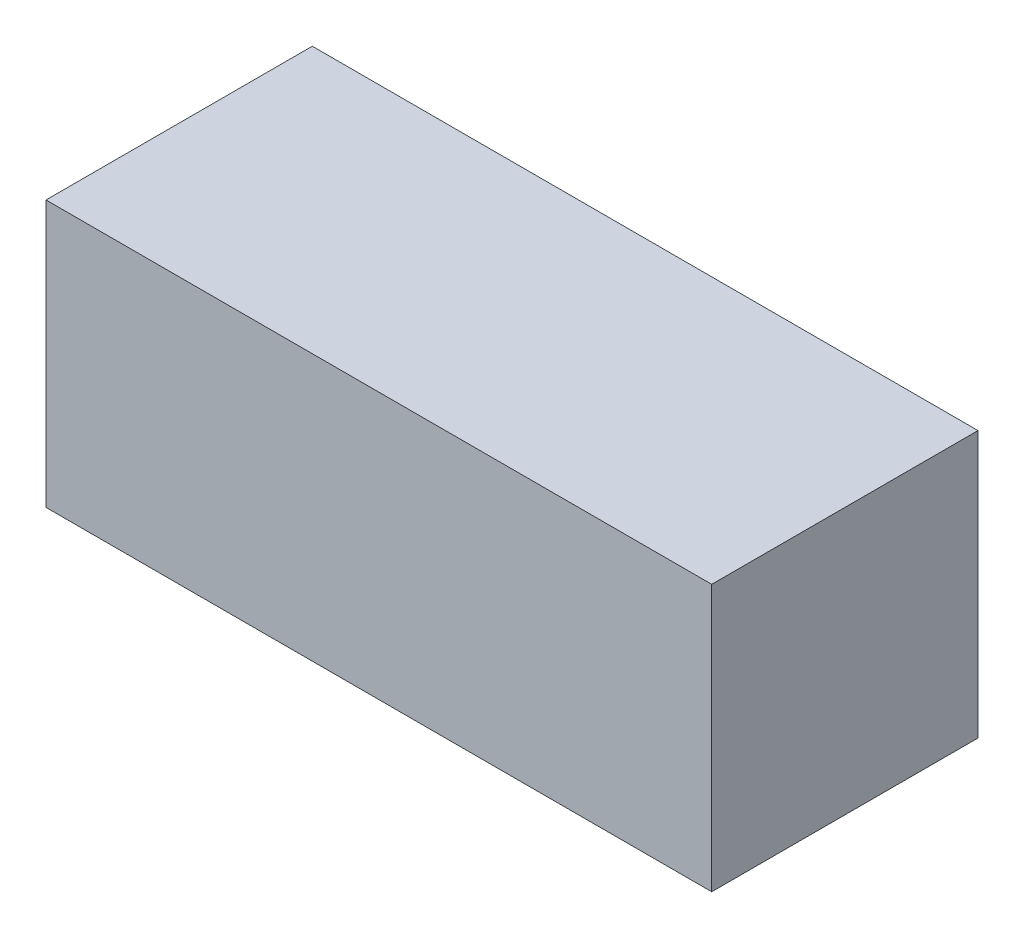
ISO-10303-21;
HEADER;
FILE_DESCRIPTION(('STEP AP214'),'2;1');
FILE_NAME('part.step','',(''),(''),'','','');
FILE_SCHEMA(('AUTOMOTIVE_DESIGN { 1 0 10303 214 1 1 1 1 }'));
ENDSEC;
DATA;
#1=APPLICATION_CONTEXT('core data for automotive mechanical design processes');
#2=APPLICATION_PROTOCOL_DEFINITION('international standard','automotive_design',2000,#1);
#3=PRODUCT_CONTEXT('',#1,'mechanical');
#4=PRODUCT('Part','Part','',(#3));
#5=PRODUCT_RELATED_PRODUCT_CATEGORY('part','',(#4));
#6=PRODUCT_DEFINITION_FORMATION('','',#4);
#7=PRODUCT_DEFINITION_CONTEXT('part definition',#1,'design');
#8=PRODUCT_DEFINITION('design','',#6,#7);
#9=PRODUCT_DEFINITION_SHAPE('','',#8);
#10=(LENGTH_UNIT() NAMED_UNIT(*) SI_UNIT(.MILLI.,.METRE.));
#11=(NAMED_UNIT(*) PLANE_ANGLE_UNIT() SI_UNIT($,.RADIAN.));
#12=(NAMED_UNIT(*) SI_UNIT($,.STERADIAN.) SOLID_ANGLE_UNIT());
#13=UNCERTAINTY_MEASURE_WITH_UNIT(LENGTH_MEASURE(1.E-05),#10,'distance_accuracy_value','');
#14=(GEOMETRIC_REPRESENTATION_CONTEXT(3) GLOBAL_UNCERTAINTY_ASSIGNED_CONTEXT((#13)) GLOBAL_UNIT_ASSIGNED_CONTEXT((#10,
#11,#12)) REPRESENTATION_CONTEXT('',''));
#15=CARTESIAN_POINT('',(0.,0.,0.));
#16=DIRECTION('',(0.,0.,1.));
#17=DIRECTION('',(1.,0.,0.));
#18=AXIS2_PLACEMENT_3D('',#15,#16,#17);
#19=CARTESIAN_POINT('',(-0.2499995,0.09999980000001,0.1999996));
#20=DIRECTION('',(0.,0.,-1.));
#21=DIRECTION('',(-1.,0.,0.));
#22=AXIS2_PLACEMENT_3D('',#19,#20,#21);
#23=PLANE('',#22);
#24=DIRECTION('',(1.,0.,0.));
#25=VECTOR('',#24,1.);
#26=CARTESIAN_POINT('',(-0.2499995,-0.09999980000001,0.1999996));
#27=LINE('',#26,#25);
#28=CARTESIAN_POINT('',(-0.2499995,-0.09999980000001,0.1999996));
#29=VERTEX_POINT('',#28);
#30=CARTESIAN_POINT('',(0.2499995,-0.09999980000001,0.1999996));
#31=VERTEX_POINT('',#30);
#32=EDGE_CURVE('E54',#29,#31,#27,.T.);
#33=ORIENTED_EDGE('',*,*,#32,.T.);
#34=DIRECTION('',(0.,1.,0.));
#35=VECTOR('',#34,1.);
#36=CARTESIAN_POINT('',(0.2499995,-0.09999980000001,0.1999996));
#37=LINE('',#36,#35);
#38=CARTESIAN_POINT('',(0.2499995,0.09999980000001,0.1999996));
#39=VERTEX_POINT('',#38);
#40=EDGE_CURVE('E56',#31,#39,#37,.T.);
#41=ORIENTED_EDGE('',*,*,#40,.T.);
#42=DIRECTION('',(1.,0.,0.));
#43=VECTOR('',#42,1.);
#44=CARTESIAN_POINT('',(0.2499995,0.09999980000001,0.1999996));
#45=LINE('',#44,#43);
#46=CARTESIAN_POINT('',(-0.2499995,0.09999980000001,0.1999996));
#47=VERTEX_POINT('',#46);
#48=EDGE_CURVE('E19',#39,#47,#45,.F.);
#49=ORIENTED_EDGE('',*,*,#48,.T.);
#50=DIRECTION('',(0.,1.,0.));
#51=VECTOR('',#50,1.);
#52=CARTESIAN_POINT('',(-0.2499995,0.09999980000001,0.1999996));
#53=LINE('',#52,#51);
#54=EDGE_CURVE('E79',#47,#29,#53,.F.);
#55=ORIENTED_EDGE('',*,*,#54,.T.);
#56=EDGE_LOOP('',(#33,#41,#49,#55));
#57=FACE_BOUND('',#56,.T.);
#58=ADVANCED_FACE('F16',(#57),#23,.F.);
#59=CARTESIAN_POINT('',(0.2499995,0.09999980000001,0.));
#60=DIRECTION('',(0.,-1.,0.));
#61=DIRECTION('',(0.,0.,-1.));
#62=AXIS2_PLACEMENT_3D('',#59,#60,#61);
#63=PLANE('',#62);
#64=DIRECTION('',(0.,0.,-1.));
#65=VECTOR('',#64,1.);
#66=CARTESIAN_POINT('',(-0.2499995,0.09999980000001,0.));
#67=LINE('',#66,#65);
#68=CARTESIAN_POINT('',(-0.2499995,0.09999980000001,0.));
#69=VERTEX_POINT('',#68);
#70=EDGE_CURVE('E67',#69,#47,#67,.F.);
#71=ORIENTED_EDGE('',*,*,#70,.T.);
#72=ORIENTED_EDGE('',*,*,#48,.F.);
#73=DIRECTION('',(0.,0.,1.));
#74=VECTOR('',#73,1.);
#75=CARTESIAN_POINT('',(0.2499995,0.09999980000001,0.));
#76=LINE('',#75,#74);
#77=CARTESIAN_POINT('',(0.2499995,0.09999980000001,0.));
#78=VERTEX_POINT('',#77);
#79=EDGE_CURVE('E62',#39,#78,#76,.F.);
#80=ORIENTED_EDGE('',*,*,#79,.T.);
#81=DIRECTION('',(-1.,0.,0.));
#82=VECTOR('',#81,1.);
#83=CARTESIAN_POINT('',(-0.2499995,0.09999980000001,0.));
#84=LINE('',#83,#82);
#85=EDGE_CURVE('E82',#69,#78,#84,.F.);
#86=ORIENTED_EDGE('',*,*,#85,.F.);
#87=EDGE_LOOP('',(#71,#72,#80,#86));
#88=FACE_BOUND('',#87,.T.);
#89=ADVANCED_FACE('F64',(#88),#63,.F.);
#90=CARTESIAN_POINT('',(0.2499995,-0.09999980000001,0.));
#91=DIRECTION('',(-1.,0.,0.));
#92=DIRECTION('',(0.,0.,1.));
#93=AXIS2_PLACEMENT_3D('',#90,#91,#92);
#94=PLANE('',#93);
#95=ORIENTED_EDGE('',*,*,#79,.F.);
#96=ORIENTED_EDGE('',*,*,#40,.F.);
#97=DIRECTION('',(0.,0.,1.));
#98=VECTOR('',#97,1.);
#99=CARTESIAN_POINT('',(0.2499995,-0.09999980000001,0.));
#100=LINE('',#99,#98);
#101=CARTESIAN_POINT('',(0.2499995,-0.09999980000001,0.));
#102=VERTEX_POINT('',#101);
#103=EDGE_CURVE('E74',#31,#102,#100,.F.);
#104=ORIENTED_EDGE('',*,*,#103,.T.);
#105=DIRECTION('',(0.,1.,0.));
#106=VECTOR('',#105,1.);
#107=CARTESIAN_POINT('',(0.2499995,0.09999980000001,0.));
#108=LINE('',#107,#106);
#109=EDGE_CURVE('E71',#78,#102,#108,.F.);
#110=ORIENTED_EDGE('',*,*,#109,.F.);
#111=EDGE_LOOP('',(#95,#96,#104,#110));
#112=FACE_BOUND('',#111,.T.);
#113=ADVANCED_FACE('F69',(#112),#94,.F.);
#114=CARTESIAN_POINT('',(-0.2499995,-0.09999980000001,0.));
#115=DIRECTION('',(0.,1.,0.));
#116=DIRECTION('',(0.,0.,1.));
#117=AXIS2_PLACEMENT_3D('',#114,#115,#116);
#118=PLANE('',#117);
#119=ORIENTED_EDGE('',*,*,#103,.F.);
#120=ORIENTED_EDGE('',*,*,#32,.F.);
#121=DIRECTION('',(0.,0.,-1.));
#122=VECTOR('',#121,1.);
#123=CARTESIAN_POINT('',(-0.2499995,-0.09999980000001,0.));
#124=LINE('',#123,#122);
#125=CARTESIAN_POINT('',(-0.2499995,-0.09999980000001,0.));
#126=VERTEX_POINT('',#125);
#127=EDGE_CURVE('E34',#29,#126,#124,.T.);
#128=ORIENTED_EDGE('',*,*,#127,.T.);
#129=DIRECTION('',(-1.,0.,0.));
#130=VECTOR('',#129,1.);
#131=CARTESIAN_POINT('',(-0.2499995,-0.09999980000001,0.));
#132=LINE('',#131,#130);
#133=EDGE_CURVE('E25',#102,#126,#132,.T.);
#134=ORIENTED_EDGE('',*,*,#133,.F.);
#135=EDGE_LOOP('',(#119,#120,#128,#134));
#136=FACE_BOUND('',#135,.T.);
#137=ADVANCED_FACE('F88',(#136),#118,.F.);
#138=CARTESIAN_POINT('',(-0.2499995,0.09999980000001,0.));
#139=DIRECTION('',(1.,0.,0.));
#140=DIRECTION('',(0.,0.,-1.));
#141=AXIS2_PLACEMENT_3D('',#138,#139,#140);
#142=PLANE('',#141);
#143=ORIENTED_EDGE('',*,*,#127,.F.);
#144=ORIENTED_EDGE('',*,*,#54,.F.);
#145=ORIENTED_EDGE('',*,*,#70,.F.);
#146=DIRECTION('',(0.,1.,0.));
#147=VECTOR('',#146,1.);
#148=CARTESIAN_POINT('',(-0.2499995,0.09999980000001,0.));
#149=LINE('',#148,#147);
#150=EDGE_CURVE('E10',#126,#69,#149,.T.);
#151=ORIENTED_EDGE('',*,*,#150,.F.);
#152=EDGE_LOOP('',(#143,#144,#145,#151));
#153=FACE_BOUND('',#152,.T.);
#154=ADVANCED_FACE('F90',(#153),#142,.F.);
#155=CARTESIAN_POINT('',(-0.2499995,0.09999980000001,0.));
#156=DIRECTION('',(0.,0.,-1.));
#157=DIRECTION('',(-1.,0.,0.));
#158=AXIS2_PLACEMENT_3D('',#155,#156,#157);
#159=PLANE('',#158);
#160=ORIENTED_EDGE('',*,*,#133,.T.);
#161=ORIENTED_EDGE('',*,*,#150,.T.);
#162=ORIENTED_EDGE('',*,*,#85,.T.);
#163=ORIENTED_EDGE('',*,*,#109,.T.);
#164=EDGE_LOOP('',(#160,#161,#162,#163));
#165=FACE_BOUND('',#164,.T.);
#166=ADVANCED_FACE('F87',(#165),#159,.T.);
#167=CLOSED_SHELL('',(#58,#89,#113,#137,#154,#166));
#168=MANIFOLD_SOLID_BREP('B1',#167);
#169=ADVANCED_BREP_SHAPE_REPRESENTATION('',(#18,#168),#14);
#170=SHAPE_DEFINITION_REPRESENTATION(#9,#169);
ENDSEC;
END-ISO-10303-21;
